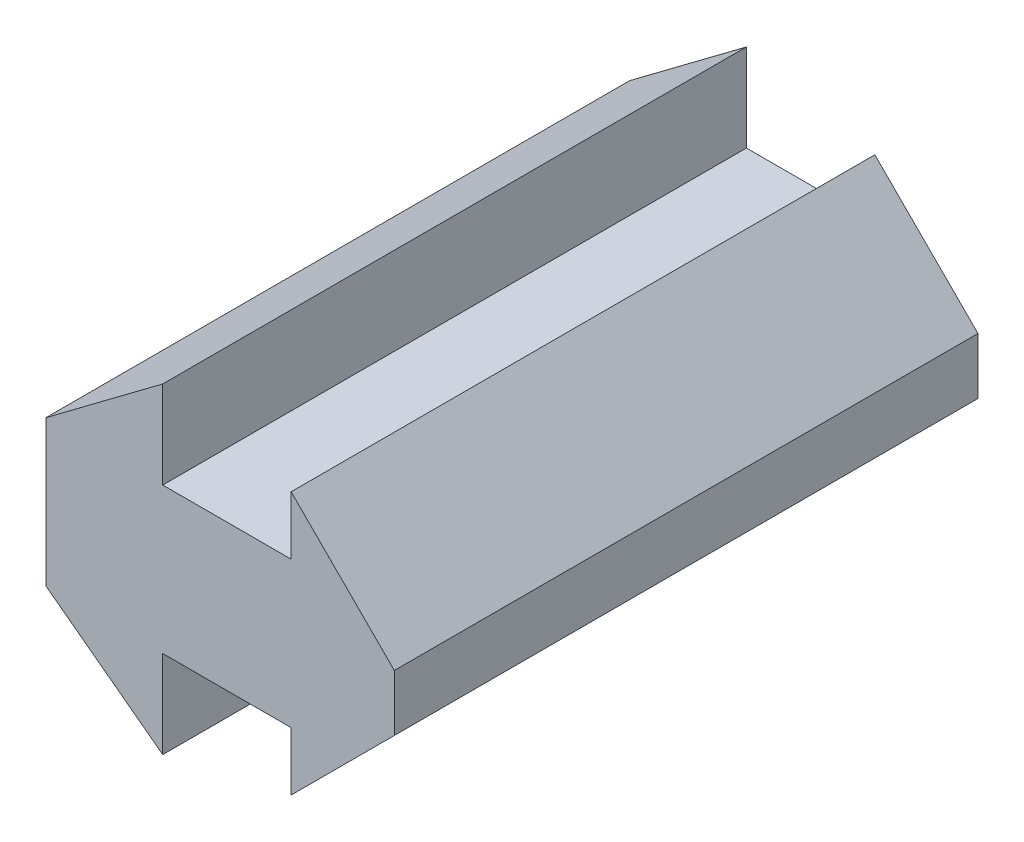
ISO-10303-21;
HEADER;
FILE_DESCRIPTION(('STEP AP214'),'2;1');
FILE_NAME('part.step','',(''),(''),'','','');
FILE_SCHEMA(('AUTOMOTIVE_DESIGN { 1 0 10303 214 1 1 1 1 }'));
ENDSEC;
DATA;
#1=APPLICATION_CONTEXT('core data for automotive mechanical design processes');
#2=APPLICATION_PROTOCOL_DEFINITION('international standard','automotive_design',2000,#1);
#3=PRODUCT_CONTEXT('',#1,'mechanical');
#4=PRODUCT('Part','Part','',(#3));
#5=PRODUCT_RELATED_PRODUCT_CATEGORY('part','',(#4));
#6=PRODUCT_DEFINITION_FORMATION('','',#4);
#7=PRODUCT_DEFINITION_CONTEXT('part definition',#1,'design');
#8=PRODUCT_DEFINITION('design','',#6,#7);
#9=PRODUCT_DEFINITION_SHAPE('','',#8);
#10=(LENGTH_UNIT() NAMED_UNIT(*) SI_UNIT(.MILLI.,.METRE.));
#11=(NAMED_UNIT(*) PLANE_ANGLE_UNIT() SI_UNIT($,.RADIAN.));
#12=(NAMED_UNIT(*) SI_UNIT($,.STERADIAN.) SOLID_ANGLE_UNIT());
#13=UNCERTAINTY_MEASURE_WITH_UNIT(LENGTH_MEASURE(1.E-05),#10,'distance_accuracy_value','');
#14=(GEOMETRIC_REPRESENTATION_CONTEXT(3) GLOBAL_UNCERTAINTY_ASSIGNED_CONTEXT((#13)) GLOBAL_UNIT_ASSIGNED_CONTEXT((#10,
#11,#12)) REPRESENTATION_CONTEXT('',''));
#15=CARTESIAN_POINT('',(0.,0.,0.));
#16=DIRECTION('',(0.,0.,1.));
#17=DIRECTION('',(1.,0.,0.));
#18=AXIS2_PLACEMENT_3D('',#15,#16,#17);
#19=CARTESIAN_POINT('',(0.,0.,20.));
#20=DIRECTION('',(0.6,0.8,0.));
#21=DIRECTION('',(-0.8,0.6,0.));
#22=AXIS2_PLACEMENT_3D('',#19,#20,#21);
#23=PLANE('',#22);
#24=DIRECTION('',(0.8,-0.6,0.));
#25=VECTOR('',#24,1.);
#26=CARTESIAN_POINT('',(0.,0.,0.));
#27=LINE('',#26,#25);
#28=CARTESIAN_POINT('',(0.,0.,0.));
#29=VERTEX_POINT('',#28);
#30=CARTESIAN_POINT('',(4.,-3.,0.));
#31=VERTEX_POINT('',#30);
#32=EDGE_CURVE('E153',#29,#31,#27,.T.);
#33=ORIENTED_EDGE('',*,*,#32,.T.);
#34=DIRECTION('',(0.,0.,-1.));
#35=VECTOR('',#34,1.);
#36=CARTESIAN_POINT('',(4.,-3.,20.));
#37=LINE('',#36,#35);
#38=CARTESIAN_POINT('',(4.,-3.,20.));
#39=VERTEX_POINT('',#38);
#40=EDGE_CURVE('E11',#39,#31,#37,.T.);
#41=ORIENTED_EDGE('',*,*,#40,.F.);
#42=DIRECTION('',(0.8,-0.6,0.));
#43=VECTOR('',#42,1.);
#44=CARTESIAN_POINT('',(0.,0.,20.));
#45=LINE('',#44,#43);
#46=CARTESIAN_POINT('',(0.,0.,20.));
#47=VERTEX_POINT('',#46);
#48=EDGE_CURVE('E175',#47,#39,#45,.T.);
#49=ORIENTED_EDGE('',*,*,#48,.F.);
#50=DIRECTION('',(0.,0.,-1.));
#51=VECTOR('',#50,1.);
#52=CARTESIAN_POINT('',(0.,0.,20.));
#53=LINE('',#52,#51);
#54=EDGE_CURVE('E149',#47,#29,#53,.T.);
#55=ORIENTED_EDGE('',*,*,#54,.T.);
#56=EDGE_LOOP('',(#33,#41,#49,#55));
#57=FACE_BOUND('',#56,.T.);
#58=ADVANCED_FACE('F33',(#57),#23,.F.);
#59=CARTESIAN_POINT('',(4.,0.,20.));
#60=DIRECTION('',(-1.,0.,0.));
#61=DIRECTION('',(0.,0.,1.));
#62=AXIS2_PLACEMENT_3D('',#59,#60,#61);
#63=PLANE('',#62);
#64=DIRECTION('',(0.,1.,0.));
#65=VECTOR('',#64,1.);
#66=CARTESIAN_POINT('',(4.,0.,0.));
#67=LINE('',#66,#65);
#68=CARTESIAN_POINT('',(4.,0.,0.));
#69=VERTEX_POINT('',#68);
#70=EDGE_CURVE('E156',#31,#69,#67,.T.);
#71=ORIENTED_EDGE('',*,*,#70,.T.);
#72=DIRECTION('',(0.,0.,-1.));
#73=VECTOR('',#72,1.);
#74=CARTESIAN_POINT('',(4.,0.,20.));
#75=LINE('',#74,#73);
#76=CARTESIAN_POINT('',(4.,0.,20.));
#77=VERTEX_POINT('',#76);
#78=EDGE_CURVE('E41',#77,#69,#75,.T.);
#79=ORIENTED_EDGE('',*,*,#78,.F.);
#80=DIRECTION('',(0.,1.,0.));
#81=VECTOR('',#80,1.);
#82=CARTESIAN_POINT('',(4.,0.,20.));
#83=LINE('',#82,#81);
#84=EDGE_CURVE('E104',#39,#77,#83,.T.);
#85=ORIENTED_EDGE('',*,*,#84,.F.);
#86=ORIENTED_EDGE('',*,*,#40,.T.);
#87=EDGE_LOOP('',(#71,#79,#85,#86));
#88=FACE_BOUND('',#87,.T.);
#89=ADVANCED_FACE('F253',(#88),#63,.F.);
#90=CARTESIAN_POINT('',(8.4,0.,20.));
#91=DIRECTION('',(0.,1.,0.));
#92=DIRECTION('',(0.,0.,1.));
#93=AXIS2_PLACEMENT_3D('',#90,#91,#92);
#94=PLANE('',#93);
#95=DIRECTION('',(1.,0.,0.));
#96=VECTOR('',#95,1.);
#97=CARTESIAN_POINT('',(8.4,0.,0.));
#98=LINE('',#97,#96);
#99=CARTESIAN_POINT('',(8.4,0.,0.));
#100=VERTEX_POINT('',#99);
#101=EDGE_CURVE('E158',#69,#100,#98,.T.);
#102=ORIENTED_EDGE('',*,*,#101,.T.);
#103=DIRECTION('',(0.,0.,-1.));
#104=VECTOR('',#103,1.);
#105=CARTESIAN_POINT('',(8.4,0.,20.));
#106=LINE('',#105,#104);
#107=CARTESIAN_POINT('',(8.4,0.,20.));
#108=VERTEX_POINT('',#107);
#109=EDGE_CURVE('E194',#108,#100,#106,.T.);
#110=ORIENTED_EDGE('',*,*,#109,.F.);
#111=DIRECTION('',(1.,0.,0.));
#112=VECTOR('',#111,1.);
#113=CARTESIAN_POINT('',(8.4,0.,20.));
#114=LINE('',#113,#112);
#115=EDGE_CURVE('E202',#77,#108,#114,.T.);
#116=ORIENTED_EDGE('',*,*,#115,.F.);
#117=ORIENTED_EDGE('',*,*,#78,.T.);
#118=EDGE_LOOP('',(#102,#110,#116,#117));
#119=FACE_BOUND('',#118,.T.);
#120=ADVANCED_FACE('F200',(#119),#94,.F.);
#121=CARTESIAN_POINT('',(8.4,0.,20.));
#122=DIRECTION('',(1.,0.,0.));
#123=DIRECTION('',(0.,0.,-1.));
#124=AXIS2_PLACEMENT_3D('',#121,#122,#123);
#125=PLANE('',#124);
#126=DIRECTION('',(0.,-1.,0.));
#127=VECTOR('',#126,1.);
#128=CARTESIAN_POINT('',(8.4,0.,0.));
#129=LINE('',#128,#127);
#130=CARTESIAN_POINT('',(8.4,-2.,0.));
#131=VERTEX_POINT('',#130);
#132=EDGE_CURVE('E160',#100,#131,#129,.T.);
#133=ORIENTED_EDGE('',*,*,#132,.T.);
#134=DIRECTION('',(0.,0.,-1.));
#135=VECTOR('',#134,1.);
#136=CARTESIAN_POINT('',(8.4,-2.,20.));
#137=LINE('',#136,#135);
#138=CARTESIAN_POINT('',(8.4,-2.,20.));
#139=VERTEX_POINT('',#138);
#140=EDGE_CURVE('E191',#139,#131,#137,.T.);
#141=ORIENTED_EDGE('',*,*,#140,.F.);
#142=DIRECTION('',(0.,-1.,0.));
#143=VECTOR('',#142,1.);
#144=CARTESIAN_POINT('',(8.4,0.,20.));
#145=LINE('',#144,#143);
#146=EDGE_CURVE('E220',#108,#139,#145,.T.);
#147=ORIENTED_EDGE('',*,*,#146,.F.);
#148=ORIENTED_EDGE('',*,*,#109,.T.);
#149=EDGE_LOOP('',(#133,#141,#147,#148));
#150=FACE_BOUND('',#149,.T.);
#151=ADVANCED_FACE('F211',(#150),#125,.F.);
#152=CARTESIAN_POINT('',(11.9355339059327,1.53553390593275,20.));
#153=DIRECTION('',(-0.707106781186551,0.707106781186544,0.));
#154=DIRECTION('',(-0.707106781186544,-0.707106781186551,0.));
#155=AXIS2_PLACEMENT_3D('',#152,#153,#154);
#156=PLANE('',#155);
#157=DIRECTION('',(0.707106781186544,0.707106781186551,0.));
#158=VECTOR('',#157,1.);
#159=CARTESIAN_POINT('',(11.9355339059327,1.53553390593275,0.));
#160=LINE('',#159,#158);
#161=CARTESIAN_POINT('',(11.9355339059327,1.53553390593275,0.));
#162=VERTEX_POINT('',#161);
#163=EDGE_CURVE('E162',#131,#162,#160,.T.);
#164=ORIENTED_EDGE('',*,*,#163,.T.);
#165=DIRECTION('',(0.,0.,-1.));
#166=VECTOR('',#165,1.);
#167=CARTESIAN_POINT('',(11.9355339059327,1.53553390593275,20.));
#168=LINE('',#167,#166);
#169=CARTESIAN_POINT('',(11.9355339059327,1.53553390593275,20.));
#170=VERTEX_POINT('',#169);
#171=EDGE_CURVE('E188',#170,#162,#168,.T.);
#172=ORIENTED_EDGE('',*,*,#171,.F.);
#173=DIRECTION('',(0.707106781186544,0.707106781186551,0.));
#174=VECTOR('',#173,1.);
#175=CARTESIAN_POINT('',(11.9355339059327,1.53553390593275,20.));
#176=LINE('',#175,#174);
#177=EDGE_CURVE('E217',#139,#170,#176,.T.);
#178=ORIENTED_EDGE('',*,*,#177,.F.);
#179=ORIENTED_EDGE('',*,*,#140,.T.);
#180=EDGE_LOOP('',(#164,#172,#178,#179));
#181=FACE_BOUND('',#180,.T.);
#182=ADVANCED_FACE('F215',(#181),#156,.F.);
#183=CARTESIAN_POINT('',(11.9355339059327,3.46446609406725,20.));
#184=DIRECTION('',(-1.,0.,0.));
#185=DIRECTION('',(0.,-1.,0.));
#186=AXIS2_PLACEMENT_3D('',#183,#184,#185);
#187=PLANE('',#186);
#188=DIRECTION('',(0.,1.,0.));
#189=VECTOR('',#188,1.);
#190=CARTESIAN_POINT('',(11.9355339059327,3.46446609406725,0.));
#191=LINE('',#190,#189);
#192=CARTESIAN_POINT('',(11.9355339059327,3.46446609406725,0.));
#193=VERTEX_POINT('',#192);
#194=EDGE_CURVE('E164',#162,#193,#191,.T.);
#195=ORIENTED_EDGE('',*,*,#194,.T.);
#196=DIRECTION('',(0.,0.,-1.));
#197=VECTOR('',#196,1.);
#198=CARTESIAN_POINT('',(11.9355339059327,3.46446609406725,20.));
#199=LINE('',#198,#197);
#200=CARTESIAN_POINT('',(11.9355339059327,3.46446609406725,20.));
#201=VERTEX_POINT('',#200);
#202=EDGE_CURVE('E185',#201,#193,#199,.T.);
#203=ORIENTED_EDGE('',*,*,#202,.F.);
#204=DIRECTION('',(0.,1.,0.));
#205=VECTOR('',#204,1.);
#206=CARTESIAN_POINT('',(11.9355339059327,3.46446609406725,20.));
#207=LINE('',#206,#205);
#208=EDGE_CURVE('E219',#170,#201,#207,.T.);
#209=ORIENTED_EDGE('',*,*,#208,.F.);
#210=ORIENTED_EDGE('',*,*,#171,.T.);
#211=EDGE_LOOP('',(#195,#203,#209,#210));
#212=FACE_BOUND('',#211,.T.);
#213=ADVANCED_FACE('F266',(#212),#187,.F.);
#214=CARTESIAN_POINT('',(8.4,7.,20.));
#215=DIRECTION('',(-0.707106781186551,-0.707106781186544,0.));
#216=DIRECTION('',(0.707106781186544,-0.707106781186551,0.));
#217=AXIS2_PLACEMENT_3D('',#214,#215,#216);
#218=PLANE('',#217);
#219=DIRECTION('',(-0.707106781186544,0.707106781186551,0.));
#220=VECTOR('',#219,1.);
#221=CARTESIAN_POINT('',(8.4,7.,0.));
#222=LINE('',#221,#220);
#223=CARTESIAN_POINT('',(8.4,7.,0.));
#224=VERTEX_POINT('',#223);
#225=EDGE_CURVE('E166',#193,#224,#222,.T.);
#226=ORIENTED_EDGE('',*,*,#225,.T.);
#227=DIRECTION('',(0.,0.,-1.));
#228=VECTOR('',#227,1.);
#229=CARTESIAN_POINT('',(8.4,7.,20.));
#230=LINE('',#229,#228);
#231=CARTESIAN_POINT('',(8.4,7.,20.));
#232=VERTEX_POINT('',#231);
#233=EDGE_CURVE('E182',#232,#224,#230,.T.);
#234=ORIENTED_EDGE('',*,*,#233,.F.);
#235=DIRECTION('',(-0.707106781186544,0.707106781186551,0.));
#236=VECTOR('',#235,1.);
#237=CARTESIAN_POINT('',(8.4,7.,20.));
#238=LINE('',#237,#236);
#239=EDGE_CURVE('E222',#201,#232,#238,.T.);
#240=ORIENTED_EDGE('',*,*,#239,.F.);
#241=ORIENTED_EDGE('',*,*,#202,.T.);
#242=EDGE_LOOP('',(#226,#234,#240,#241));
#243=FACE_BOUND('',#242,.T.);
#244=ADVANCED_FACE('F269',(#243),#218,.F.);
#245=CARTESIAN_POINT('',(8.4,5.,20.));
#246=DIRECTION('',(1.,0.,0.));
#247=DIRECTION('',(0.,1.,0.));
#248=AXIS2_PLACEMENT_3D('',#245,#246,#247);
#249=PLANE('',#248);
#250=DIRECTION('',(0.,-1.,0.));
#251=VECTOR('',#250,1.);
#252=CARTESIAN_POINT('',(8.4,5.,0.));
#253=LINE('',#252,#251);
#254=CARTESIAN_POINT('',(8.4,5.,0.));
#255=VERTEX_POINT('',#254);
#256=EDGE_CURVE('E168',#224,#255,#253,.T.);
#257=ORIENTED_EDGE('',*,*,#256,.T.);
#258=DIRECTION('',(0.,0.,-1.));
#259=VECTOR('',#258,1.);
#260=CARTESIAN_POINT('',(8.4,5.,20.));
#261=LINE('',#260,#259);
#262=CARTESIAN_POINT('',(8.4,5.,20.));
#263=VERTEX_POINT('',#262);
#264=EDGE_CURVE('E179',#263,#255,#261,.T.);
#265=ORIENTED_EDGE('',*,*,#264,.F.);
#266=DIRECTION('',(0.,-1.,0.));
#267=VECTOR('',#266,1.);
#268=CARTESIAN_POINT('',(8.4,5.,20.));
#269=LINE('',#268,#267);
#270=EDGE_CURVE('E228',#232,#263,#269,.T.);
#271=ORIENTED_EDGE('',*,*,#270,.F.);
#272=ORIENTED_EDGE('',*,*,#233,.T.);
#273=EDGE_LOOP('',(#257,#265,#271,#272));
#274=FACE_BOUND('',#273,.T.);
#275=ADVANCED_FACE('F234',(#274),#249,.F.);
#276=CARTESIAN_POINT('',(4.,5.,20.));
#277=DIRECTION('',(0.,-1.,0.));
#278=DIRECTION('',(0.,0.,-1.));
#279=AXIS2_PLACEMENT_3D('',#276,#277,#278);
#280=PLANE('',#279);
#281=DIRECTION('',(-1.,0.,0.));
#282=VECTOR('',#281,1.);
#283=CARTESIAN_POINT('',(4.,5.,0.));
#284=LINE('',#283,#282);
#285=CARTESIAN_POINT('',(4.,5.,0.));
#286=VERTEX_POINT('',#285);
#287=EDGE_CURVE('E170',#255,#286,#284,.T.);
#288=ORIENTED_EDGE('',*,*,#287,.T.);
#289=DIRECTION('',(0.,0.,-1.));
#290=VECTOR('',#289,1.);
#291=CARTESIAN_POINT('',(4.,5.,20.));
#292=LINE('',#291,#290);
#293=CARTESIAN_POINT('',(4.,5.,20.));
#294=VERTEX_POINT('',#293);
#295=EDGE_CURVE('E144',#294,#286,#292,.T.);
#296=ORIENTED_EDGE('',*,*,#295,.F.);
#297=DIRECTION('',(-1.,0.,0.));
#298=VECTOR('',#297,1.);
#299=CARTESIAN_POINT('',(4.,5.,20.));
#300=LINE('',#299,#298);
#301=EDGE_CURVE('E135',#263,#294,#300,.T.);
#302=ORIENTED_EDGE('',*,*,#301,.F.);
#303=ORIENTED_EDGE('',*,*,#264,.T.);
#304=EDGE_LOOP('',(#288,#296,#302,#303));
#305=FACE_BOUND('',#304,.T.);
#306=ADVANCED_FACE('F238',(#305),#280,.F.);
#307=CARTESIAN_POINT('',(4.,8.,20.));
#308=DIRECTION('',(-1.,0.,0.));
#309=DIRECTION('',(0.,0.,1.));
#310=AXIS2_PLACEMENT_3D('',#307,#308,#309);
#311=PLANE('',#310);
#312=DIRECTION('',(0.,1.,0.));
#313=VECTOR('',#312,1.);
#314=CARTESIAN_POINT('',(4.,8.,0.));
#315=LINE('',#314,#313);
#316=CARTESIAN_POINT('',(4.,8.,0.));
#317=VERTEX_POINT('',#316);
#318=EDGE_CURVE('E143',#286,#317,#315,.T.);
#319=ORIENTED_EDGE('',*,*,#318,.T.);
#320=DIRECTION('',(0.,0.,-1.));
#321=VECTOR('',#320,1.);
#322=CARTESIAN_POINT('',(4.,8.,20.));
#323=LINE('',#322,#321);
#324=CARTESIAN_POINT('',(4.,8.,20.));
#325=VERTEX_POINT('',#324);
#326=EDGE_CURVE('E140',#325,#317,#323,.T.);
#327=ORIENTED_EDGE('',*,*,#326,.F.);
#328=DIRECTION('',(0.,1.,0.));
#329=VECTOR('',#328,1.);
#330=CARTESIAN_POINT('',(4.,8.,20.));
#331=LINE('',#330,#329);
#332=EDGE_CURVE('E129',#294,#325,#331,.T.);
#333=ORIENTED_EDGE('',*,*,#332,.F.);
#334=ORIENTED_EDGE('',*,*,#295,.T.);
#335=EDGE_LOOP('',(#319,#327,#333,#334));
#336=FACE_BOUND('',#335,.T.);
#337=ADVANCED_FACE('F141',(#336),#311,.F.);
#338=CARTESIAN_POINT('',(0.,5.,20.));
#339=DIRECTION('',(0.6,-0.8,0.));
#340=DIRECTION('',(0.8,0.6,0.));
#341=AXIS2_PLACEMENT_3D('',#338,#339,#340);
#342=PLANE('',#341);
#343=DIRECTION('',(-0.8,-0.6,0.));
#344=VECTOR('',#343,1.);
#345=CARTESIAN_POINT('',(0.,5.,0.));
#346=LINE('',#345,#344);
#347=CARTESIAN_POINT('',(0.,5.,0.));
#348=VERTEX_POINT('',#347);
#349=EDGE_CURVE('E90',#317,#348,#346,.T.);
#350=ORIENTED_EDGE('',*,*,#349,.T.);
#351=DIRECTION('',(0.,0.,-1.));
#352=VECTOR('',#351,1.);
#353=CARTESIAN_POINT('',(0.,5.,20.));
#354=LINE('',#353,#352);
#355=CARTESIAN_POINT('',(0.,5.,20.));
#356=VERTEX_POINT('',#355);
#357=EDGE_CURVE('E145',#356,#348,#354,.T.);
#358=ORIENTED_EDGE('',*,*,#357,.F.);
#359=DIRECTION('',(-0.8,-0.6,0.));
#360=VECTOR('',#359,1.);
#361=CARTESIAN_POINT('',(0.,5.,20.));
#362=LINE('',#361,#360);
#363=EDGE_CURVE('E133',#325,#356,#362,.T.);
#364=ORIENTED_EDGE('',*,*,#363,.F.);
#365=ORIENTED_EDGE('',*,*,#326,.T.);
#366=EDGE_LOOP('',(#350,#358,#364,#365));
#367=FACE_BOUND('',#366,.T.);
#368=ADVANCED_FACE('F147',(#367),#342,.F.);
#369=CARTESIAN_POINT('',(0.,0.,20.));
#370=DIRECTION('',(1.,0.,0.));
#371=DIRECTION('',(0.,0.,-1.));
#372=AXIS2_PLACEMENT_3D('',#369,#370,#371);
#373=PLANE('',#372);
#374=DIRECTION('',(0.,-1.,0.));
#375=VECTOR('',#374,1.);
#376=CARTESIAN_POINT('',(0.,0.,0.));
#377=LINE('',#376,#375);
#378=EDGE_CURVE('E96',#348,#29,#377,.T.);
#379=ORIENTED_EDGE('',*,*,#378,.T.);
#380=ORIENTED_EDGE('',*,*,#54,.F.);
#381=DIRECTION('',(0.,-1.,0.));
#382=VECTOR('',#381,1.);
#383=CARTESIAN_POINT('',(0.,0.,20.));
#384=LINE('',#383,#382);
#385=EDGE_CURVE('E49',#356,#47,#384,.T.);
#386=ORIENTED_EDGE('',*,*,#385,.F.);
#387=ORIENTED_EDGE('',*,*,#357,.T.);
#388=EDGE_LOOP('',(#379,#380,#386,#387));
#389=FACE_BOUND('',#388,.T.);
#390=ADVANCED_FACE('F242',(#389),#373,.F.);
#391=CARTESIAN_POINT('',(0.,0.,20.));
#392=DIRECTION('',(0.,0.,-1.));
#393=DIRECTION('',(-1.,0.,0.));
#394=AXIS2_PLACEMENT_3D('',#391,#392,#393);
#395=PLANE('',#394);
#396=ORIENTED_EDGE('',*,*,#48,.T.);
#397=ORIENTED_EDGE('',*,*,#84,.T.);
#398=ORIENTED_EDGE('',*,*,#115,.T.);
#399=ORIENTED_EDGE('',*,*,#146,.T.);
#400=ORIENTED_EDGE('',*,*,#177,.T.);
#401=ORIENTED_EDGE('',*,*,#208,.T.);
#402=ORIENTED_EDGE('',*,*,#239,.T.);
#403=ORIENTED_EDGE('',*,*,#270,.T.);
#404=ORIENTED_EDGE('',*,*,#301,.T.);
#405=ORIENTED_EDGE('',*,*,#332,.T.);
#406=ORIENTED_EDGE('',*,*,#363,.T.);
#407=ORIENTED_EDGE('',*,*,#385,.T.);
#408=EDGE_LOOP('',(#396,#397,#398,#399,#400,#401,#402,#403,#404,#405,#406,#407));
#409=FACE_BOUND('',#408,.T.);
#410=ADVANCED_FACE('F131',(#409),#395,.F.);
#411=CARTESIAN_POINT('',(0.,0.,0.));
#412=DIRECTION('',(0.,0.,-1.));
#413=DIRECTION('',(-1.,0.,0.));
#414=AXIS2_PLACEMENT_3D('',#411,#412,#413);
#415=PLANE('',#414);
#416=ORIENTED_EDGE('',*,*,#32,.F.);
#417=ORIENTED_EDGE('',*,*,#378,.F.);
#418=ORIENTED_EDGE('',*,*,#349,.F.);
#419=ORIENTED_EDGE('',*,*,#318,.F.);
#420=ORIENTED_EDGE('',*,*,#287,.F.);
#421=ORIENTED_EDGE('',*,*,#256,.F.);
#422=ORIENTED_EDGE('',*,*,#225,.F.);
#423=ORIENTED_EDGE('',*,*,#194,.F.);
#424=ORIENTED_EDGE('',*,*,#163,.F.);
#425=ORIENTED_EDGE('',*,*,#132,.F.);
#426=ORIENTED_EDGE('',*,*,#101,.F.);
#427=ORIENTED_EDGE('',*,*,#70,.F.);
#428=EDGE_LOOP('',(#416,#417,#418,#419,#420,#421,#422,#423,#424,#425,#426,#427));
#429=FACE_BOUND('',#428,.T.);
#430=ADVANCED_FACE('F206',(#429),#415,.T.);
#431=CLOSED_SHELL('',(#58,#89,#120,#151,#182,#213,#244,#275,#306,#337,#368,#390,#410,#430));
#432=MANIFOLD_SOLID_BREP('B2',#431);
#433=ADVANCED_BREP_SHAPE_REPRESENTATION('',(#18,#432),#14);
#434=SHAPE_DEFINITION_REPRESENTATION(#9,#433);
ENDSEC;
END-ISO-10303-21;
